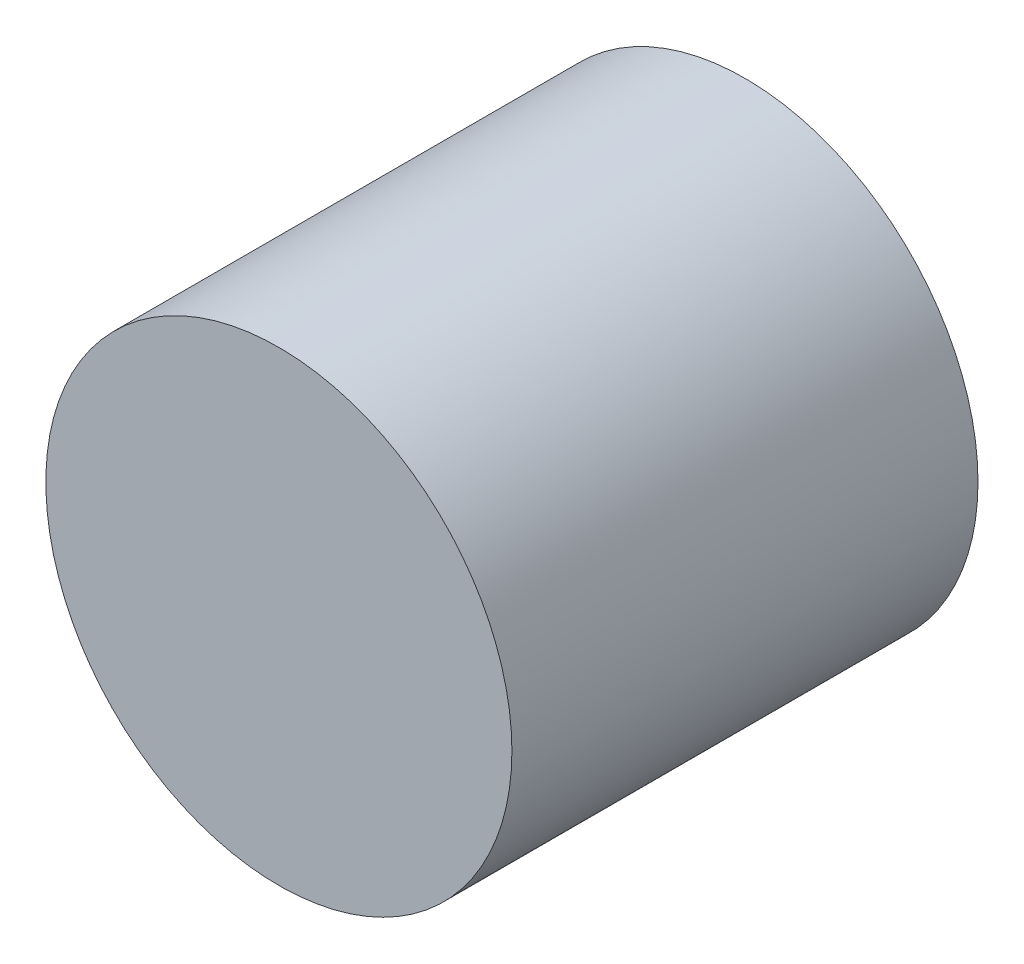
ISO-10303-21;
HEADER;
FILE_DESCRIPTION(('STEP AP214'),'2;1');
FILE_NAME('part.step','',(''),(''),'','','');
FILE_SCHEMA(('AUTOMOTIVE_DESIGN { 1 0 10303 214 1 1 1 1 }'));
ENDSEC;
DATA;
#1=APPLICATION_CONTEXT('core data for automotive mechanical design processes');
#2=APPLICATION_PROTOCOL_DEFINITION('international standard','automotive_design',2000,#1);
#3=PRODUCT_CONTEXT('',#1,'mechanical');
#4=PRODUCT('Part','Part','',(#3));
#5=PRODUCT_RELATED_PRODUCT_CATEGORY('part','',(#4));
#6=PRODUCT_DEFINITION_FORMATION('','',#4);
#7=PRODUCT_DEFINITION_CONTEXT('part definition',#1,'design');
#8=PRODUCT_DEFINITION('design','',#6,#7);
#9=PRODUCT_DEFINITION_SHAPE('','',#8);
#10=(LENGTH_UNIT() NAMED_UNIT(*) SI_UNIT(.MILLI.,.METRE.));
#11=(NAMED_UNIT(*) PLANE_ANGLE_UNIT() SI_UNIT($,.RADIAN.));
#12=(NAMED_UNIT(*) SI_UNIT($,.STERADIAN.) SOLID_ANGLE_UNIT());
#13=UNCERTAINTY_MEASURE_WITH_UNIT(LENGTH_MEASURE(1.E-05),#10,'distance_accuracy_value','');
#14=(GEOMETRIC_REPRESENTATION_CONTEXT(3) GLOBAL_UNCERTAINTY_ASSIGNED_CONTEXT((#13)) GLOBAL_UNIT_ASSIGNED_CONTEXT((#10,
#11,#12)) REPRESENTATION_CONTEXT('',''));
#15=CARTESIAN_POINT('',(0.,0.,0.));
#16=DIRECTION('',(0.,0.,1.));
#17=DIRECTION('',(1.,0.,0.));
#18=AXIS2_PLACEMENT_3D('',#15,#16,#17);
#19=CARTESIAN_POINT('',(0.,0.,7.));
#20=DIRECTION('',(0.,0.,-1.));
#21=DIRECTION('',(-1.,0.,0.));
#22=AXIS2_PLACEMENT_3D('',#19,#20,#21);
#23=CYLINDRICAL_SURFACE('',#22,3.5);
#24=CARTESIAN_POINT('',(0.,0.,7.));
#25=DIRECTION('',(0.,0.,1.));
#26=DIRECTION('',(1.,0.,0.));
#27=AXIS2_PLACEMENT_3D('',#24,#25,#26);
#28=CIRCLE('',#27,3.5);
#29=CARTESIAN_POINT('',(3.5,0.,7.));
#30=VERTEX_POINT('',#29);
#31=EDGE_CURVE('E10',#30,#30,#28,.T.);
#32=ORIENTED_EDGE('',*,*,#31,.F.);
#33=EDGE_LOOP('',(#32));
#34=FACE_BOUND('',#33,.T.);
#35=CARTESIAN_POINT('',(0.,0.,0.));
#36=DIRECTION('',(0.,0.,1.));
#37=DIRECTION('',(1.,0.,0.));
#38=AXIS2_PLACEMENT_3D('',#35,#36,#37);
#39=CIRCLE('',#38,3.5);
#40=CARTESIAN_POINT('',(3.5,0.,0.));
#41=VERTEX_POINT('',#40);
#42=EDGE_CURVE('E34',#41,#41,#39,.T.);
#43=ORIENTED_EDGE('',*,*,#42,.T.);
#44=EDGE_LOOP('',(#43));
#45=FACE_BOUND('',#44,.T.);
#46=ADVANCED_FACE('F31',(#34,#45),#23,.T.);
#47=CARTESIAN_POINT('',(0.,0.,7.));
#48=DIRECTION('',(0.,0.,1.));
#49=DIRECTION('',(1.,0.,0.));
#50=AXIS2_PLACEMENT_3D('',#47,#48,#49);
#51=PLANE('',#50);
#52=ORIENTED_EDGE('',*,*,#31,.T.);
#53=EDGE_LOOP('',(#52));
#54=FACE_BOUND('',#53,.T.);
#55=ADVANCED_FACE('F60',(#54),#51,.T.);
#56=CARTESIAN_POINT('',(0.,0.,0.));
#57=DIRECTION('',(0.,0.,1.));
#58=DIRECTION('',(1.,0.,0.));
#59=AXIS2_PLACEMENT_3D('',#56,#57,#58);
#60=PLANE('',#59);
#61=CARTESIAN_POINT('',(0.,0.,0.));
#62=DIRECTION('',(0.,0.,-1.));
#63=DIRECTION('',(-1.,0.,0.));
#64=AXIS2_PLACEMENT_3D('',#61,#62,#63);
#65=CIRCLE('',#64,2.75);
#66=CARTESIAN_POINT('',(-2.75,0.,0.));
#67=VERTEX_POINT('',#66);
#68=EDGE_CURVE('E43',#67,#67,#65,.T.);
#69=ORIENTED_EDGE('',*,*,#68,.F.);
#70=EDGE_LOOP('',(#69));
#71=FACE_BOUND('',#70,.T.);
#72=ORIENTED_EDGE('',*,*,#42,.F.);
#73=EDGE_LOOP('',(#72));
#74=FACE_BOUND('',#73,.T.);
#75=ADVANCED_FACE('F54',(#71,#74),#60,.F.);
#76=CARTESIAN_POINT('',(0.,0.,4.5));
#77=DIRECTION('',(0.,0.,-1.));
#78=DIRECTION('',(-1.,0.,0.));
#79=AXIS2_PLACEMENT_3D('',#76,#77,#78);
#80=CYLINDRICAL_SURFACE('',#79,2.75);
#81=CARTESIAN_POINT('',(0.,0.,4.5));
#82=DIRECTION('',(0.,0.,-1.));
#83=DIRECTION('',(-1.,0.,0.));
#84=AXIS2_PLACEMENT_3D('',#81,#82,#83);
#85=CIRCLE('',#84,2.75);
#86=CARTESIAN_POINT('',(-2.75,0.,4.5));
#87=VERTEX_POINT('',#86);
#88=EDGE_CURVE('E41',#87,#87,#85,.T.);
#89=ORIENTED_EDGE('',*,*,#88,.F.);
#90=EDGE_LOOP('',(#89));
#91=FACE_BOUND('',#90,.T.);
#92=ORIENTED_EDGE('',*,*,#68,.T.);
#93=EDGE_LOOP('',(#92));
#94=FACE_BOUND('',#93,.T.);
#95=ADVANCED_FACE('F51',(#91,#94),#80,.F.);
#96=CARTESIAN_POINT('',(0.,0.,4.5));
#97=DIRECTION('',(0.,0.,-1.));
#98=DIRECTION('',(-1.,0.,0.));
#99=AXIS2_PLACEMENT_3D('',#96,#97,#98);
#100=PLANE('',#99);
#101=ORIENTED_EDGE('',*,*,#88,.T.);
#102=EDGE_LOOP('',(#101));
#103=FACE_BOUND('',#102,.T.);
#104=ADVANCED_FACE('F49',(#103),#100,.T.);
#105=CLOSED_SHELL('',(#46,#55,#75,#95,#104));
#106=MANIFOLD_SOLID_BREP('B2',#105);
#107=ADVANCED_BREP_SHAPE_REPRESENTATION('',(#18,#106),#14);
#108=SHAPE_DEFINITION_REPRESENTATION(#9,#107);
ENDSEC;
END-ISO-10303-21;
